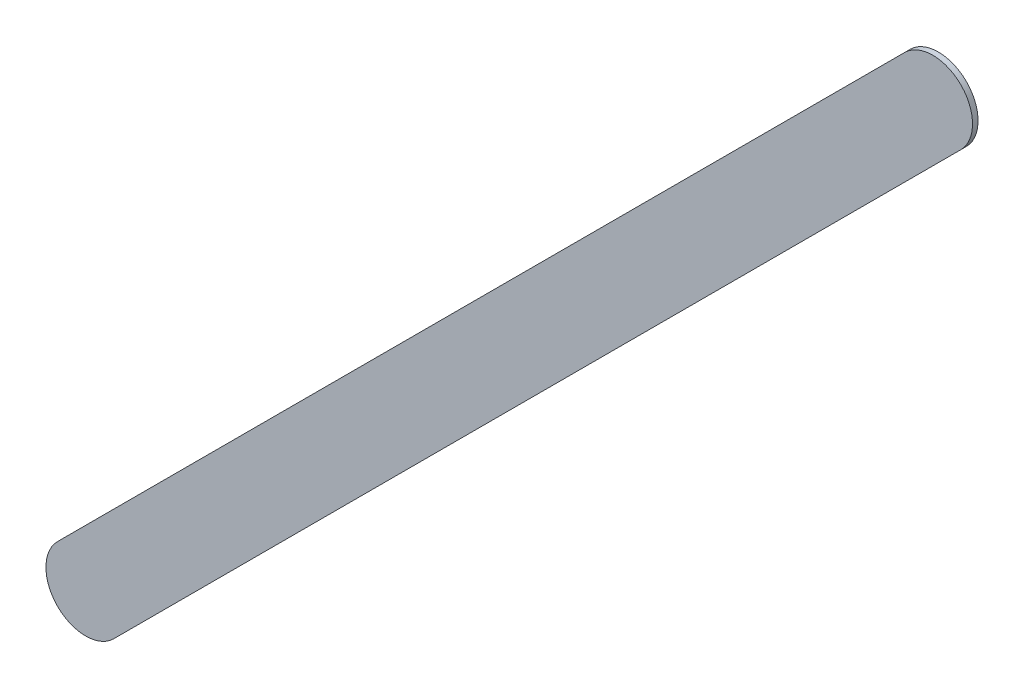
ISO-10303-21;
HEADER;
FILE_DESCRIPTION(('STEP AP214'),'2;1');
FILE_NAME('part.step','',(''),(''),'','','');
FILE_SCHEMA(('AUTOMOTIVE_DESIGN { 1 0 10303 214 1 1 1 1 }'));
ENDSEC;
DATA;
#1=APPLICATION_CONTEXT('core data for automotive mechanical design processes');
#2=APPLICATION_PROTOCOL_DEFINITION('international standard','automotive_design',2000,#1);
#3=PRODUCT_CONTEXT('',#1,'mechanical');
#4=PRODUCT('Part','Part','',(#3));
#5=PRODUCT_RELATED_PRODUCT_CATEGORY('part','',(#4));
#6=PRODUCT_DEFINITION_FORMATION('','',#4);
#7=PRODUCT_DEFINITION_CONTEXT('part definition',#1,'design');
#8=PRODUCT_DEFINITION('design','',#6,#7);
#9=PRODUCT_DEFINITION_SHAPE('','',#8);
#10=(LENGTH_UNIT() NAMED_UNIT(*) SI_UNIT(.MILLI.,.METRE.));
#11=(NAMED_UNIT(*) PLANE_ANGLE_UNIT() SI_UNIT($,.RADIAN.));
#12=(NAMED_UNIT(*) SI_UNIT($,.STERADIAN.) SOLID_ANGLE_UNIT());
#13=UNCERTAINTY_MEASURE_WITH_UNIT(LENGTH_MEASURE(1.E-05),#10,'distance_accuracy_value','');
#14=(GEOMETRIC_REPRESENTATION_CONTEXT(3) GLOBAL_UNCERTAINTY_ASSIGNED_CONTEXT((#13)) GLOBAL_UNIT_ASSIGNED_CONTEXT((#10,
#11,#12)) REPRESENTATION_CONTEXT('',''));
#15=CARTESIAN_POINT('',(0.,0.,0.));
#16=DIRECTION('',(0.,0.,1.));
#17=DIRECTION('',(1.,0.,0.));
#18=AXIS2_PLACEMENT_3D('',#15,#16,#17);
#19=CARTESIAN_POINT('',(144.702776,-111.631976,0.));
#20=DIRECTION('',(0.,0.,1.));
#21=DIRECTION('',(1.,0.,0.));
#22=AXIS2_PLACEMENT_3D('',#19,#20,#21);
#23=PLANE('',#22);
#24=DIRECTION('',(0.707106781186548,0.707106781186548,0.));
#25=VECTOR('',#24,1.);
#26=CARTESIAN_POINT('',(144.702776,-111.631976,0.));
#27=LINE('',#26,#25);
#28=CARTESIAN_POINT('',(144.702776,-111.631976,0.));
#29=VERTEX_POINT('',#28);
#30=CARTESIAN_POINT('',(150.036776,-106.297976,0.));
#31=VERTEX_POINT('',#30);
#32=EDGE_CURVE('E82',#29,#31,#27,.T.);
#33=ORIENTED_EDGE('',*,*,#32,.T.);
#34=CARTESIAN_POINT('',(149.8599995,-106.1211995,0.));
#35=DIRECTION('',(0.,0.,1.));
#36=DIRECTION('',(0.707106781186548,-0.707106781186548,0.));
#37=AXIS2_PLACEMENT_3D('',#34,#35,#36);
#38=CIRCLE('',#37,0.249999723809);
#39=CARTESIAN_POINT('',(149.683223,-105.944423,0.));
#40=VERTEX_POINT('',#39);
#41=EDGE_CURVE('E108',#31,#40,#38,.T.);
#42=ORIENTED_EDGE('',*,*,#41,.T.);
#43=DIRECTION('',(-0.707106781186548,-0.707106781186548,0.));
#44=VECTOR('',#43,1.);
#45=CARTESIAN_POINT('',(149.683223,-105.944423,0.));
#46=LINE('',#45,#44);
#47=CARTESIAN_POINT('',(144.349223,-111.278423,0.));
#48=VERTEX_POINT('',#47);
#49=EDGE_CURVE('E74',#40,#48,#46,.T.);
#50=ORIENTED_EDGE('',*,*,#49,.T.);
#51=CARTESIAN_POINT('',(144.5259995,-111.4551995,0.));
#52=DIRECTION('',(0.,0.,1.));
#53=DIRECTION('',(-0.707106781187048,0.707106781186048,0.));
#54=AXIS2_PLACEMENT_3D('',#51,#52,#53);
#55=CIRCLE('',#54,0.249999723809);
#56=EDGE_CURVE('E11',#48,#29,#55,.T.);
#57=ORIENTED_EDGE('',*,*,#56,.T.);
#58=EDGE_LOOP('',(#33,#42,#50,#57));
#59=FACE_BOUND('',#58,.T.);
#60=ADVANCED_FACE('F17',(#59),#23,.T.);
#61=CARTESIAN_POINT('',(144.702776,-111.631976,-0.035));
#62=DIRECTION('',(0.,0.,1.));
#63=DIRECTION('',(1.,0.,0.));
#64=AXIS2_PLACEMENT_3D('',#61,#62,#63);
#65=PLANE('',#64);
#66=CARTESIAN_POINT('',(144.5259995,-111.4551995,-0.035));
#67=DIRECTION('',(0.,0.,1.));
#68=DIRECTION('',(-0.707106781187048,0.707106781186048,0.));
#69=AXIS2_PLACEMENT_3D('',#66,#67,#68);
#70=CIRCLE('',#69,0.249999723809);
#71=CARTESIAN_POINT('',(144.349223,-111.278423,-0.035));
#72=VERTEX_POINT('',#71);
#73=CARTESIAN_POINT('',(144.702776,-111.631976,-0.035));
#74=VERTEX_POINT('',#73);
#75=EDGE_CURVE('E25',#72,#74,#70,.T.);
#76=ORIENTED_EDGE('',*,*,#75,.F.);
#77=DIRECTION('',(-0.707106781186548,-0.707106781186548,0.));
#78=VECTOR('',#77,1.);
#79=CARTESIAN_POINT('',(149.683223,-105.944423,-0.035));
#80=LINE('',#79,#78);
#81=CARTESIAN_POINT('',(149.683223,-105.944423,-0.035));
#82=VERTEX_POINT('',#81);
#83=EDGE_CURVE('E111',#82,#72,#80,.T.);
#84=ORIENTED_EDGE('',*,*,#83,.F.);
#85=CARTESIAN_POINT('',(149.8599995,-106.1211995,-0.035));
#86=DIRECTION('',(0.,0.,1.));
#87=DIRECTION('',(0.707106781186548,-0.707106781186548,0.));
#88=AXIS2_PLACEMENT_3D('',#85,#86,#87);
#89=CIRCLE('',#88,0.249999723809);
#90=CARTESIAN_POINT('',(150.036776,-106.297976,-0.035));
#91=VERTEX_POINT('',#90);
#92=EDGE_CURVE('E84',#91,#82,#89,.T.);
#93=ORIENTED_EDGE('',*,*,#92,.F.);
#94=DIRECTION('',(0.707106781186548,0.707106781186548,0.));
#95=VECTOR('',#94,1.);
#96=CARTESIAN_POINT('',(144.702776,-111.631976,-0.035));
#97=LINE('',#96,#95);
#98=EDGE_CURVE('E80',#74,#91,#97,.T.);
#99=ORIENTED_EDGE('',*,*,#98,.F.);
#100=EDGE_LOOP('',(#76,#84,#93,#99));
#101=FACE_BOUND('',#100,.T.);
#102=ADVANCED_FACE('F86',(#101),#65,.F.);
#103=CARTESIAN_POINT('',(144.5259995,-111.4551995,-0.035));
#104=DIRECTION('',(0.,0.,-1.));
#105=DIRECTION('',(-0.707106781187048,0.707106781186048,0.));
#106=AXIS2_PLACEMENT_3D('',#103,#104,#105);
#107=CYLINDRICAL_SURFACE('',#106,0.249999723809);
#108=ORIENTED_EDGE('',*,*,#75,.T.);
#109=DIRECTION('',(0.,0.,1.));
#110=VECTOR('',#109,1.);
#111=CARTESIAN_POINT('',(144.702776,-111.631976,-0.035));
#112=LINE('',#111,#110);
#113=EDGE_CURVE('E68',#74,#29,#112,.T.);
#114=ORIENTED_EDGE('',*,*,#113,.T.);
#115=ORIENTED_EDGE('',*,*,#56,.F.);
#116=DIRECTION('',(0.,0.,1.));
#117=VECTOR('',#116,1.);
#118=CARTESIAN_POINT('',(144.349223,-111.278423,-0.035));
#119=LINE('',#118,#117);
#120=EDGE_CURVE('E71',#72,#48,#119,.T.);
#121=ORIENTED_EDGE('',*,*,#120,.F.);
#122=EDGE_LOOP('',(#108,#114,#115,#121));
#123=FACE_BOUND('',#122,.T.);
#124=ADVANCED_FACE('F67',(#123),#107,.T.);
#125=CARTESIAN_POINT('',(149.683223,-105.944423,-0.035));
#126=DIRECTION('',(0.707106781186548,-0.707106781186548,0.));
#127=DIRECTION('',(0.,0.,-1.));
#128=AXIS2_PLACEMENT_3D('',#125,#126,#127);
#129=PLANE('',#128);
#130=ORIENTED_EDGE('',*,*,#83,.T.);
#131=ORIENTED_EDGE('',*,*,#120,.T.);
#132=ORIENTED_EDGE('',*,*,#49,.F.);
#133=DIRECTION('',(0.,0.,1.));
#134=VECTOR('',#133,1.);
#135=CARTESIAN_POINT('',(149.683223,-105.944423,-0.035));
#136=LINE('',#135,#134);
#137=EDGE_CURVE('E104',#82,#40,#136,.T.);
#138=ORIENTED_EDGE('',*,*,#137,.F.);
#139=EDGE_LOOP('',(#130,#131,#132,#138));
#140=FACE_BOUND('',#139,.T.);
#141=ADVANCED_FACE('F118',(#140),#129,.F.);
#142=CARTESIAN_POINT('',(149.8599995,-106.1211995,-0.035));
#143=DIRECTION('',(0.,0.,-1.));
#144=DIRECTION('',(0.707106781186548,-0.707106781186548,0.));
#145=AXIS2_PLACEMENT_3D('',#142,#143,#144);
#146=CYLINDRICAL_SURFACE('',#145,0.249999723809);
#147=ORIENTED_EDGE('',*,*,#92,.T.);
#148=ORIENTED_EDGE('',*,*,#137,.T.);
#149=ORIENTED_EDGE('',*,*,#41,.F.);
#150=DIRECTION('',(0.,0.,1.));
#151=VECTOR('',#150,1.);
#152=CARTESIAN_POINT('',(150.036776,-106.297976,-0.035));
#153=LINE('',#152,#151);
#154=EDGE_CURVE('E90',#91,#31,#153,.T.);
#155=ORIENTED_EDGE('',*,*,#154,.F.);
#156=EDGE_LOOP('',(#147,#148,#149,#155));
#157=FACE_BOUND('',#156,.T.);
#158=ADVANCED_FACE('F121',(#157),#146,.T.);
#159=CARTESIAN_POINT('',(144.702776,-111.631976,-0.035));
#160=DIRECTION('',(-0.707106781186548,0.707106781186548,0.));
#161=DIRECTION('',(0.,0.,1.));
#162=AXIS2_PLACEMENT_3D('',#159,#160,#161);
#163=PLANE('',#162);
#164=ORIENTED_EDGE('',*,*,#98,.T.);
#165=ORIENTED_EDGE('',*,*,#154,.T.);
#166=ORIENTED_EDGE('',*,*,#32,.F.);
#167=ORIENTED_EDGE('',*,*,#113,.F.);
#168=EDGE_LOOP('',(#164,#165,#166,#167));
#169=FACE_BOUND('',#168,.T.);
#170=ADVANCED_FACE('F78',(#169),#163,.F.);
#171=CLOSED_SHELL('',(#60,#102,#124,#141,#158,#170));
#172=MANIFOLD_SOLID_BREP('B1',#171);
#173=ADVANCED_BREP_SHAPE_REPRESENTATION('',(#18,#172),#14);
#174=SHAPE_DEFINITION_REPRESENTATION(#9,#173);
ENDSEC;
END-ISO-10303-21;
